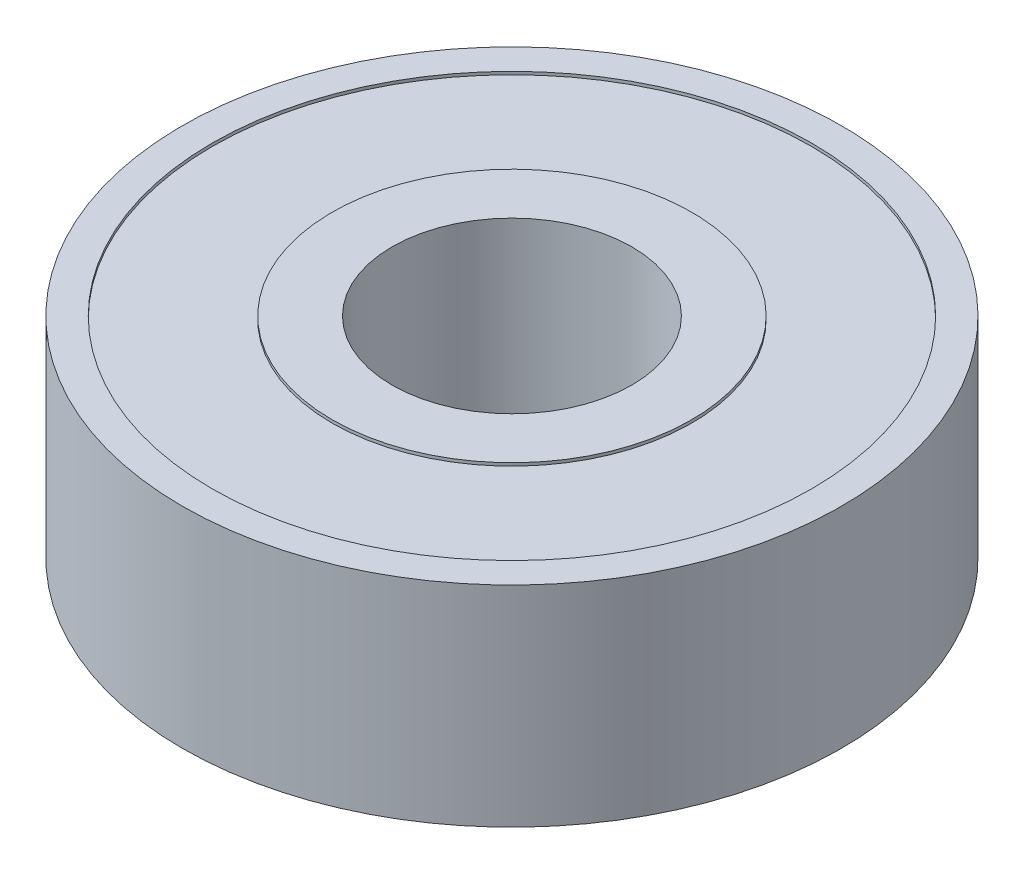
ISO-10303-21;
HEADER;
FILE_DESCRIPTION(('STEP AP214'),'2;1');
FILE_NAME('part.step','',(''),(''),'','','');
FILE_SCHEMA(('AUTOMOTIVE_DESIGN { 1 0 10303 214 1 1 1 1 }'));
ENDSEC;
DATA;
#1=APPLICATION_CONTEXT('core data for automotive mechanical design processes');
#2=APPLICATION_PROTOCOL_DEFINITION('international standard','automotive_design',2000,#1);
#3=PRODUCT_CONTEXT('',#1,'mechanical');
#4=PRODUCT('Part','Part','',(#3));
#5=PRODUCT_RELATED_PRODUCT_CATEGORY('part','',(#4));
#6=PRODUCT_DEFINITION_FORMATION('','',#4);
#7=PRODUCT_DEFINITION_CONTEXT('part definition',#1,'design');
#8=PRODUCT_DEFINITION('design','',#6,#7);
#9=PRODUCT_DEFINITION_SHAPE('','',#8);
#10=(LENGTH_UNIT() NAMED_UNIT(*) SI_UNIT(.MILLI.,.METRE.));
#11=(NAMED_UNIT(*) PLANE_ANGLE_UNIT() SI_UNIT($,.RADIAN.));
#12=(NAMED_UNIT(*) SI_UNIT($,.STERADIAN.) SOLID_ANGLE_UNIT());
#13=UNCERTAINTY_MEASURE_WITH_UNIT(LENGTH_MEASURE(1.E-05),#10,'distance_accuracy_value','');
#14=(GEOMETRIC_REPRESENTATION_CONTEXT(3) GLOBAL_UNCERTAINTY_ASSIGNED_CONTEXT((#13)) GLOBAL_UNIT_ASSIGNED_CONTEXT((#10,
#11,#12)) REPRESENTATION_CONTEXT('',''));
#15=CARTESIAN_POINT('',(0.,0.,0.));
#16=DIRECTION('',(0.,0.,1.));
#17=DIRECTION('',(1.,0.,0.));
#18=AXIS2_PLACEMENT_3D('',#15,#16,#17);
#19=CARTESIAN_POINT('',(0.,-3.5,0.));
#20=DIRECTION('',(0.,1.,0.));
#21=DIRECTION('',(0.,0.,1.));
#22=AXIS2_PLACEMENT_3D('',#19,#20,#21);
#23=PLANE('',#22);
#24=CARTESIAN_POINT('',(0.,-3.5,0.));
#25=DIRECTION('',(0.,1.,0.));
#26=DIRECTION('',(0.,0.,1.));
#27=AXIS2_PLACEMENT_3D('',#24,#25,#26);
#28=CIRCLE('',#27,4.);
#29=CARTESIAN_POINT('',(0.,-3.5,4.));
#30=VERTEX_POINT('',#29);
#31=EDGE_CURVE('E53',#30,#30,#28,.T.);
#32=ORIENTED_EDGE('',*,*,#31,.T.);
#33=EDGE_LOOP('',(#32));
#34=FACE_BOUND('',#33,.T.);
#35=CARTESIAN_POINT('',(0.,-3.5,0.));
#36=DIRECTION('',(0.,1.,0.));
#37=DIRECTION('',(0.,0.,1.));
#38=AXIS2_PLACEMENT_3D('',#35,#36,#37);
#39=CIRCLE('',#38,6.);
#40=CARTESIAN_POINT('',(0.,-3.5,6.));
#41=VERTEX_POINT('',#40);
#42=EDGE_CURVE('E77',#41,#41,#39,.T.);
#43=ORIENTED_EDGE('',*,*,#42,.F.);
#44=EDGE_LOOP('',(#43));
#45=FACE_BOUND('',#44,.T.);
#46=ADVANCED_FACE('F40',(#34,#45),#23,.F.);
#47=CARTESIAN_POINT('',(0.,3.5,0.));
#48=DIRECTION('',(0.,1.,0.));
#49=DIRECTION('',(0.,0.,1.));
#50=AXIS2_PLACEMENT_3D('',#47,#48,#49);
#51=PLANE('',#50);
#52=CARTESIAN_POINT('',(0.,3.5,0.));
#53=DIRECTION('',(0.,1.,0.));
#54=DIRECTION('',(0.,0.,1.));
#55=AXIS2_PLACEMENT_3D('',#52,#53,#54);
#56=CIRCLE('',#55,4.);
#57=CARTESIAN_POINT('',(0.,3.5,4.));
#58=VERTEX_POINT('',#57);
#59=EDGE_CURVE('E51',#58,#58,#56,.T.);
#60=ORIENTED_EDGE('',*,*,#59,.F.);
#61=EDGE_LOOP('',(#60));
#62=FACE_BOUND('',#61,.T.);
#63=CARTESIAN_POINT('',(0.,3.5,0.));
#64=DIRECTION('',(0.,1.,0.));
#65=DIRECTION('',(0.,0.,1.));
#66=AXIS2_PLACEMENT_3D('',#63,#64,#65);
#67=CIRCLE('',#66,6.);
#68=CARTESIAN_POINT('',(0.,3.5,6.));
#69=VERTEX_POINT('',#68);
#70=EDGE_CURVE('E65',#69,#69,#67,.T.);
#71=ORIENTED_EDGE('',*,*,#70,.T.);
#72=EDGE_LOOP('',(#71));
#73=FACE_BOUND('',#72,.T.);
#74=ADVANCED_FACE('F93',(#62,#73),#51,.T.);
#75=CARTESIAN_POINT('',(0.,3.5,0.));
#76=DIRECTION('',(0.,1.,0.));
#77=DIRECTION('',(0.,0.,1.));
#78=AXIS2_PLACEMENT_3D('',#75,#76,#77);
#79=CIRCLE('',#78,10.);
#80=CARTESIAN_POINT('',(0.,3.5,10.));
#81=VERTEX_POINT('',#80);
#82=EDGE_CURVE('E59',#81,#81,#79,.T.);
#83=ORIENTED_EDGE('',*,*,#82,.F.);
#84=EDGE_LOOP('',(#83));
#85=FACE_BOUND('',#84,.T.);
#86=CARTESIAN_POINT('',(0.,3.5,0.));
#87=DIRECTION('',(0.,1.,0.));
#88=DIRECTION('',(0.,0.,1.));
#89=AXIS2_PLACEMENT_3D('',#86,#87,#88);
#90=CIRCLE('',#89,11.);
#91=CARTESIAN_POINT('',(0.,3.5,11.));
#92=VERTEX_POINT('',#91);
#93=EDGE_CURVE('E10',#92,#92,#90,.T.);
#94=ORIENTED_EDGE('',*,*,#93,.T.);
#95=EDGE_LOOP('',(#94));
#96=FACE_BOUND('',#95,.T.);
#97=ADVANCED_FACE('F99',(#85,#96),#51,.T.);
#98=CARTESIAN_POINT('',(0.,-3.5,0.));
#99=DIRECTION('',(0.,1.,0.));
#100=DIRECTION('',(0.,0.,1.));
#101=AXIS2_PLACEMENT_3D('',#98,#99,#100);
#102=CIRCLE('',#101,10.);
#103=CARTESIAN_POINT('',(0.,-3.5,10.));
#104=VERTEX_POINT('',#103);
#105=EDGE_CURVE('E71',#104,#104,#102,.T.);
#106=ORIENTED_EDGE('',*,*,#105,.T.);
#107=EDGE_LOOP('',(#106));
#108=FACE_BOUND('',#107,.T.);
#109=CARTESIAN_POINT('',(0.,-3.5,0.));
#110=DIRECTION('',(0.,1.,0.));
#111=DIRECTION('',(0.,0.,1.));
#112=AXIS2_PLACEMENT_3D('',#109,#110,#111);
#113=CIRCLE('',#112,11.);
#114=CARTESIAN_POINT('',(0.,-3.5,11.));
#115=VERTEX_POINT('',#114);
#116=EDGE_CURVE('E44',#115,#115,#113,.T.);
#117=ORIENTED_EDGE('',*,*,#116,.F.);
#118=EDGE_LOOP('',(#117));
#119=FACE_BOUND('',#118,.T.);
#120=ADVANCED_FACE('F95',(#108,#119),#23,.F.);
#121=CARTESIAN_POINT('',(0.,3.5,0.));
#122=DIRECTION('',(0.,-1.,0.));
#123=DIRECTION('',(0.,0.,-1.));
#124=AXIS2_PLACEMENT_3D('',#121,#122,#123);
#125=CYLINDRICAL_SURFACE('',#124,11.);
#126=ORIENTED_EDGE('',*,*,#93,.F.);
#127=EDGE_LOOP('',(#126));
#128=FACE_BOUND('',#127,.T.);
#129=ORIENTED_EDGE('',*,*,#116,.T.);
#130=EDGE_LOOP('',(#129));
#131=FACE_BOUND('',#130,.T.);
#132=ADVANCED_FACE('F42',(#128,#131),#125,.T.);
#133=CARTESIAN_POINT('',(0.,3.5,0.));
#134=DIRECTION('',(0.,-1.,0.));
#135=DIRECTION('',(0.,0.,-1.));
#136=AXIS2_PLACEMENT_3D('',#133,#134,#135);
#137=CYLINDRICAL_SURFACE('',#136,4.);
#138=ORIENTED_EDGE('',*,*,#59,.T.);
#139=EDGE_LOOP('',(#138));
#140=FACE_BOUND('',#139,.T.);
#141=ORIENTED_EDGE('',*,*,#31,.F.);
#142=EDGE_LOOP('',(#141));
#143=FACE_BOUND('',#142,.T.);
#144=ADVANCED_FACE('F108',(#140,#143),#137,.F.);
#145=CARTESIAN_POINT('',(0.,3.4,0.));
#146=DIRECTION('',(0.,1.,0.));
#147=DIRECTION('',(0.,0.,1.));
#148=AXIS2_PLACEMENT_3D('',#145,#146,#147);
#149=CYLINDRICAL_SURFACE('',#148,10.);
#150=CARTESIAN_POINT('',(0.,3.4,0.));
#151=DIRECTION('',(0.,1.,0.));
#152=DIRECTION('',(0.,0.,1.));
#153=AXIS2_PLACEMENT_3D('',#150,#151,#152);
#154=CIRCLE('',#153,10.);
#155=CARTESIAN_POINT('',(0.,3.4,10.));
#156=VERTEX_POINT('',#155);
#157=EDGE_CURVE('E56',#156,#156,#154,.T.);
#158=ORIENTED_EDGE('',*,*,#157,.F.);
#159=EDGE_LOOP('',(#158));
#160=FACE_BOUND('',#159,.T.);
#161=ORIENTED_EDGE('',*,*,#82,.T.);
#162=EDGE_LOOP('',(#161));
#163=FACE_BOUND('',#162,.T.);
#164=ADVANCED_FACE('F132',(#160,#163),#149,.F.);
#165=CARTESIAN_POINT('',(0.,3.4,0.));
#166=DIRECTION('',(0.,1.,0.));
#167=DIRECTION('',(0.,0.,1.));
#168=AXIS2_PLACEMENT_3D('',#165,#166,#167);
#169=PLANE('',#168);
#170=CARTESIAN_POINT('',(0.,3.4,0.));
#171=DIRECTION('',(0.,1.,0.));
#172=DIRECTION('',(0.,0.,1.));
#173=AXIS2_PLACEMENT_3D('',#170,#171,#172);
#174=CIRCLE('',#173,6.);
#175=CARTESIAN_POINT('',(0.,3.4,6.));
#176=VERTEX_POINT('',#175);
#177=EDGE_CURVE('E62',#176,#176,#174,.T.);
#178=ORIENTED_EDGE('',*,*,#177,.F.);
#179=EDGE_LOOP('',(#178));
#180=FACE_BOUND('',#179,.T.);
#181=ORIENTED_EDGE('',*,*,#157,.T.);
#182=EDGE_LOOP('',(#181));
#183=FACE_BOUND('',#182,.T.);
#184=ADVANCED_FACE('F128',(#180,#183),#169,.T.);
#185=CARTESIAN_POINT('',(0.,3.4,0.));
#186=DIRECTION('',(0.,1.,0.));
#187=DIRECTION('',(0.,0.,1.));
#188=AXIS2_PLACEMENT_3D('',#185,#186,#187);
#189=CYLINDRICAL_SURFACE('',#188,6.);
#190=ORIENTED_EDGE('',*,*,#177,.T.);
#191=EDGE_LOOP('',(#190));
#192=FACE_BOUND('',#191,.T.);
#193=ORIENTED_EDGE('',*,*,#70,.F.);
#194=EDGE_LOOP('',(#193));
#195=FACE_BOUND('',#194,.T.);
#196=ADVANCED_FACE('F122',(#192,#195),#189,.T.);
#197=CARTESIAN_POINT('',(0.,-3.4,0.));
#198=DIRECTION('',(0.,-1.,0.));
#199=DIRECTION('',(0.,0.,1.));
#200=AXIS2_PLACEMENT_3D('',#197,#198,#199);
#201=PLANE('',#200);
#202=CARTESIAN_POINT('',(0.,-3.4,0.));
#203=DIRECTION('',(0.,1.,0.));
#204=DIRECTION('',(0.,0.,1.));
#205=AXIS2_PLACEMENT_3D('',#202,#203,#204);
#206=CIRCLE('',#205,10.);
#207=CARTESIAN_POINT('',(0.,-3.4,10.));
#208=VERTEX_POINT('',#207);
#209=EDGE_CURVE('E68',#208,#208,#206,.T.);
#210=ORIENTED_EDGE('',*,*,#209,.F.);
#211=EDGE_LOOP('',(#210));
#212=FACE_BOUND('',#211,.T.);
#213=CARTESIAN_POINT('',(0.,-3.4,0.));
#214=DIRECTION('',(0.,1.,0.));
#215=DIRECTION('',(0.,0.,1.));
#216=AXIS2_PLACEMENT_3D('',#213,#214,#215);
#217=CIRCLE('',#216,6.);
#218=CARTESIAN_POINT('',(0.,-3.4,6.));
#219=VERTEX_POINT('',#218);
#220=EDGE_CURVE('E74',#219,#219,#217,.T.);
#221=ORIENTED_EDGE('',*,*,#220,.T.);
#222=EDGE_LOOP('',(#221));
#223=FACE_BOUND('',#222,.T.);
#224=ADVANCED_FACE('F83',(#212,#223),#201,.T.);
#225=CARTESIAN_POINT('',(0.,-3.4,0.));
#226=DIRECTION('',(0.,-1.,0.));
#227=DIRECTION('',(0.,0.,-1.));
#228=AXIS2_PLACEMENT_3D('',#225,#226,#227);
#229=CYLINDRICAL_SURFACE('',#228,10.);
#230=ORIENTED_EDGE('',*,*,#209,.T.);
#231=EDGE_LOOP('',(#230));
#232=FACE_BOUND('',#231,.T.);
#233=ORIENTED_EDGE('',*,*,#105,.F.);
#234=EDGE_LOOP('',(#233));
#235=FACE_BOUND('',#234,.T.);
#236=ADVANCED_FACE('F88',(#232,#235),#229,.F.);
#237=CARTESIAN_POINT('',(0.,-3.4,0.));
#238=DIRECTION('',(0.,-1.,0.));
#239=DIRECTION('',(0.,0.,-1.));
#240=AXIS2_PLACEMENT_3D('',#237,#238,#239);
#241=CYLINDRICAL_SURFACE('',#240,6.);
#242=ORIENTED_EDGE('',*,*,#220,.F.);
#243=EDGE_LOOP('',(#242));
#244=FACE_BOUND('',#243,.T.);
#245=ORIENTED_EDGE('',*,*,#42,.T.);
#246=EDGE_LOOP('',(#245));
#247=FACE_BOUND('',#246,.T.);
#248=ADVANCED_FACE('F85',(#244,#247),#241,.T.);
#249=CLOSED_SHELL('',(#46,#74,#97,#120,#132,#144,#164,#184,#196,#224,#236,#248));
#250=MANIFOLD_SOLID_BREP('B2',#249);
#251=ADVANCED_BREP_SHAPE_REPRESENTATION('',(#18,#250),#14);
#252=SHAPE_DEFINITION_REPRESENTATION(#9,#251);
ENDSEC;
END-ISO-10303-21;
